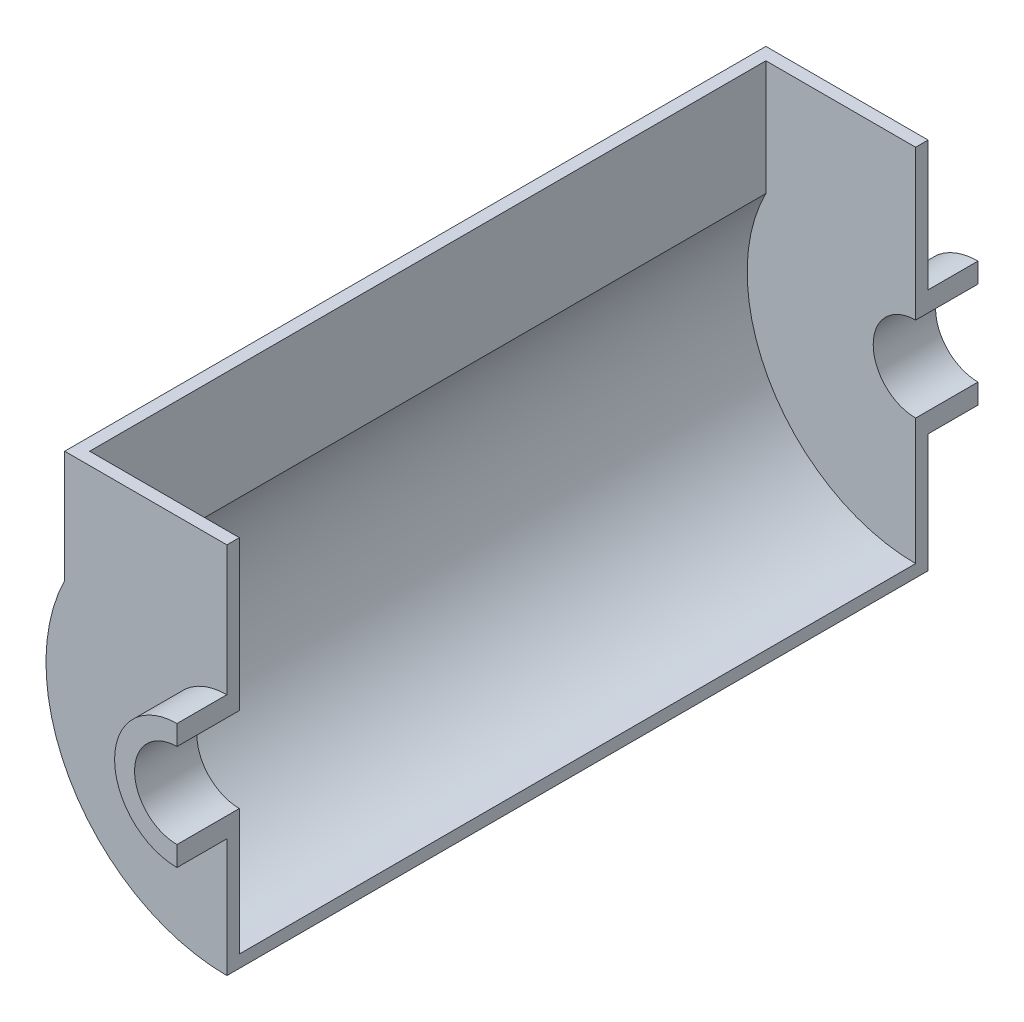
ISO-10303-21;
HEADER;
FILE_DESCRIPTION(('STEP AP214'),'2;1');
FILE_NAME('part.step','',(''),(''),'','','');
FILE_SCHEMA(('AUTOMOTIVE_DESIGN { 1 0 10303 214 1 1 1 1 }'));
ENDSEC;
DATA;
#1=APPLICATION_CONTEXT('core data for automotive mechanical design processes');
#2=APPLICATION_PROTOCOL_DEFINITION('international standard','automotive_design',2000,#1);
#3=PRODUCT_CONTEXT('',#1,'mechanical');
#4=PRODUCT('Part','Part','',(#3));
#5=PRODUCT_RELATED_PRODUCT_CATEGORY('part','',(#4));
#6=PRODUCT_DEFINITION_FORMATION('','',#4);
#7=PRODUCT_DEFINITION_CONTEXT('part definition',#1,'design');
#8=PRODUCT_DEFINITION('design','',#6,#7);
#9=PRODUCT_DEFINITION_SHAPE('','',#8);
#10=(LENGTH_UNIT() NAMED_UNIT(*) SI_UNIT(.MILLI.,.METRE.));
#11=(NAMED_UNIT(*) PLANE_ANGLE_UNIT() SI_UNIT($,.RADIAN.));
#12=(NAMED_UNIT(*) SI_UNIT($,.STERADIAN.) SOLID_ANGLE_UNIT());
#13=UNCERTAINTY_MEASURE_WITH_UNIT(LENGTH_MEASURE(1.E-05),#10,'distance_accuracy_value','');
#14=(GEOMETRIC_REPRESENTATION_CONTEXT(3) GLOBAL_UNCERTAINTY_ASSIGNED_CONTEXT((#13)) GLOBAL_UNIT_ASSIGNED_CONTEXT((#10,
#11,#12)) REPRESENTATION_CONTEXT('',''));
#15=CARTESIAN_POINT('',(0.,0.,0.));
#16=DIRECTION('',(0.,0.,1.));
#17=DIRECTION('',(1.,0.,0.));
#18=AXIS2_PLACEMENT_3D('',#15,#16,#17);
#19=CARTESIAN_POINT('',(0.,0.,-5.));
#20=DIRECTION('',(0.,0.,1.));
#21=DIRECTION('',(1.,0.,0.));
#22=AXIS2_PLACEMENT_3D('',#19,#20,#21);
#23=CYLINDRICAL_SURFACE('',#22,17.);
#24=DIRECTION('',(0.,0.,1.));
#25=VECTOR('',#24,1.);
#26=CARTESIAN_POINT('',(0.,17.,-5.));
#27=LINE('',#26,#25);
#28=CARTESIAN_POINT('',(0.,17.,-5.));
#29=VERTEX_POINT('',#28);
#30=CARTESIAN_POINT('',(0.,17.,20.));
#31=VERTEX_POINT('',#30);
#32=EDGE_CURVE('E44',#29,#31,#27,.T.);
#33=ORIENTED_EDGE('',*,*,#32,.T.);
#34=CARTESIAN_POINT('',(0.,0.,20.));
#35=DIRECTION('',(0.,0.,-1.));
#36=DIRECTION('',(1.,0.,0.));
#37=AXIS2_PLACEMENT_3D('',#34,#35,#36);
#38=CIRCLE('',#37,17.);
#39=CARTESIAN_POINT('',(0.,-17.,20.));
#40=VERTEX_POINT('',#39);
#41=EDGE_CURVE('E259',#40,#31,#38,.T.);
#42=ORIENTED_EDGE('',*,*,#41,.F.);
#43=DIRECTION('',(0.,0.,1.));
#44=VECTOR('',#43,1.);
#45=CARTESIAN_POINT('',(0.,-17.,-5.));
#46=LINE('',#45,#44);
#47=CARTESIAN_POINT('',(0.,-17.,-5.));
#48=VERTEX_POINT('',#47);
#49=EDGE_CURVE('E11',#48,#40,#46,.T.);
#50=ORIENTED_EDGE('',*,*,#49,.F.);
#51=CARTESIAN_POINT('',(0.,0.,-5.));
#52=DIRECTION('',(0.,0.,-1.));
#53=DIRECTION('',(1.,0.,0.));
#54=AXIS2_PLACEMENT_3D('',#51,#52,#53);
#55=CIRCLE('',#54,17.);
#56=EDGE_CURVE('E283',#48,#29,#55,.T.);
#57=ORIENTED_EDGE('',*,*,#56,.T.);
#58=EDGE_LOOP('',(#33,#42,#50,#57));
#59=FACE_BOUND('',#58,.T.);
#60=ADVANCED_FACE('F41',(#59),#23,.F.);
#61=CARTESIAN_POINT('',(0.,-17.,-5.));
#62=DIRECTION('',(1.,0.,0.));
#63=DIRECTION('',(0.,0.,-1.));
#64=AXIS2_PLACEMENT_3D('',#61,#62,#63);
#65=PLANE('',#64);
#66=ORIENTED_EDGE('',*,*,#49,.T.);
#67=DIRECTION('',(0.,1.,0.));
#68=VECTOR('',#67,1.);
#69=CARTESIAN_POINT('',(0.,-17.,20.));
#70=LINE('',#69,#68);
#71=CARTESIAN_POINT('',(0.,-25.,20.));
#72=VERTEX_POINT('',#71);
#73=EDGE_CURVE('E279',#72,#40,#70,.T.);
#74=ORIENTED_EDGE('',*,*,#73,.F.);
#75=DIRECTION('',(0.,0.,1.));
#76=VECTOR('',#75,1.);
#77=CARTESIAN_POINT('',(0.,-25.,-5.));
#78=LINE('',#77,#76);
#79=CARTESIAN_POINT('',(0.,-25.,0.));
#80=VERTEX_POINT('',#79);
#81=EDGE_CURVE('E50',#80,#72,#78,.T.);
#82=ORIENTED_EDGE('',*,*,#81,.F.);
#83=DIRECTION('',(0.,1.,0.));
#84=VECTOR('',#83,1.);
#85=CARTESIAN_POINT('',(0.,-25.,0.));
#86=LINE('',#85,#84);
#87=CARTESIAN_POINT('',(0.,-72.5,0.));
#88=VERTEX_POINT('',#87);
#89=EDGE_CURVE('E234',#88,#80,#86,.T.);
#90=ORIENTED_EDGE('',*,*,#89,.F.);
#91=DIRECTION('',(0.,0.,1.));
#92=VECTOR('',#91,1.);
#93=CARTESIAN_POINT('',(0.,-72.5,-5.));
#94=LINE('',#93,#92);
#95=CARTESIAN_POINT('',(0.,-72.5,-281.));
#96=VERTEX_POINT('',#95);
#97=EDGE_CURVE('E256',#96,#88,#94,.T.);
#98=ORIENTED_EDGE('',*,*,#97,.F.);
#99=DIRECTION('',(0.,1.,0.));
#100=VECTOR('',#99,1.);
#101=CARTESIAN_POINT('',(0.,-25.,-281.));
#102=LINE('',#101,#100);
#103=CARTESIAN_POINT('',(0.,-25.,-281.));
#104=VERTEX_POINT('',#103);
#105=EDGE_CURVE('E167',#96,#104,#102,.T.);
#106=ORIENTED_EDGE('',*,*,#105,.T.);
#107=DIRECTION('',(0.,0.,-1.));
#108=VECTOR('',#107,1.);
#109=CARTESIAN_POINT('',(0.,-25.,-276.));
#110=LINE('',#109,#108);
#111=CARTESIAN_POINT('',(0.,-25.,-301.));
#112=VERTEX_POINT('',#111);
#113=EDGE_CURVE('E199',#104,#112,#110,.T.);
#114=ORIENTED_EDGE('',*,*,#113,.T.);
#115=DIRECTION('',(0.,1.,0.));
#116=VECTOR('',#115,1.);
#117=CARTESIAN_POINT('',(0.,-17.,-301.));
#118=LINE('',#117,#116);
#119=CARTESIAN_POINT('',(0.,-17.,-301.));
#120=VERTEX_POINT('',#119);
#121=EDGE_CURVE('E190',#112,#120,#118,.T.);
#122=ORIENTED_EDGE('',*,*,#121,.T.);
#123=DIRECTION('',(0.,0.,-1.));
#124=VECTOR('',#123,1.);
#125=CARTESIAN_POINT('',(0.,-17.,-276.));
#126=LINE('',#125,#124);
#127=CARTESIAN_POINT('',(0.,-17.,-276.));
#128=VERTEX_POINT('',#127);
#129=EDGE_CURVE('E194',#128,#120,#126,.T.);
#130=ORIENTED_EDGE('',*,*,#129,.F.);
#131=DIRECTION('',(0.,1.,0.));
#132=VECTOR('',#131,1.);
#133=CARTESIAN_POINT('',(0.,-17.,-276.));
#134=LINE('',#133,#132);
#135=CARTESIAN_POINT('',(0.,-67.5,-276.));
#136=VERTEX_POINT('',#135);
#137=EDGE_CURVE('E184',#136,#128,#134,.T.);
#138=ORIENTED_EDGE('',*,*,#137,.F.);
#139=DIRECTION('',(0.,0.,1.));
#140=VECTOR('',#139,1.);
#141=CARTESIAN_POINT('',(0.,-67.5,-442.152038807834));
#142=LINE('',#141,#140);
#143=CARTESIAN_POINT('',(0.,-67.5,-5.));
#144=VERTEX_POINT('',#143);
#145=EDGE_CURVE('E223',#136,#144,#142,.T.);
#146=ORIENTED_EDGE('',*,*,#145,.T.);
#147=DIRECTION('',(0.,1.,0.));
#148=VECTOR('',#147,1.);
#149=CARTESIAN_POINT('',(0.,-17.,-5.));
#150=LINE('',#149,#148);
#151=EDGE_CURVE('E290',#144,#48,#150,.T.);
#152=ORIENTED_EDGE('',*,*,#151,.T.);
#153=EDGE_LOOP('',(#66,#74,#82,#90,#98,#106,#114,#122,#130,#138,#146,#152));
#154=FACE_BOUND('',#153,.T.);
#155=ADVANCED_FACE('F311',(#154),#65,.T.);
#156=CARTESIAN_POINT('',(0.,0.,-5.));
#157=DIRECTION('',(0.,0.,1.));
#158=DIRECTION('',(1.,0.,0.));
#159=AXIS2_PLACEMENT_3D('',#156,#157,#158);
#160=CYLINDRICAL_SURFACE('',#159,25.);
#161=CARTESIAN_POINT('',(0.,0.,0.));
#162=DIRECTION('',(0.,0.,-1.));
#163=DIRECTION('',(1.,0.,0.));
#164=AXIS2_PLACEMENT_3D('',#161,#162,#163);
#165=CIRCLE('',#164,25.);
#166=CARTESIAN_POINT('',(0.,25.,0.));
#167=VERTEX_POINT('',#166);
#168=EDGE_CURVE('E66',#80,#167,#165,.T.);
#169=ORIENTED_EDGE('',*,*,#168,.F.);
#170=ORIENTED_EDGE('',*,*,#81,.T.);
#171=CARTESIAN_POINT('',(0.,0.,20.));
#172=DIRECTION('',(0.,0.,1.));
#173=DIRECTION('',(1.,0.,0.));
#174=AXIS2_PLACEMENT_3D('',#171,#172,#173);
#175=CIRCLE('',#174,25.);
#176=CARTESIAN_POINT('',(0.,25.,20.));
#177=VERTEX_POINT('',#176);
#178=EDGE_CURVE('E275',#177,#72,#175,.T.);
#179=ORIENTED_EDGE('',*,*,#178,.F.);
#180=DIRECTION('',(0.,0.,1.));
#181=VECTOR('',#180,1.);
#182=CARTESIAN_POINT('',(0.,25.,-5.));
#183=LINE('',#182,#181);
#184=EDGE_CURVE('E294',#167,#177,#183,.T.);
#185=ORIENTED_EDGE('',*,*,#184,.F.);
#186=EDGE_LOOP('',(#169,#170,#179,#185));
#187=FACE_BOUND('',#186,.T.);
#188=ADVANCED_FACE('F385',(#187),#160,.T.);
#189=CARTESIAN_POINT('',(0.,25.,-5.));
#190=DIRECTION('',(1.,0.,0.));
#191=DIRECTION('',(0.,0.,-1.));
#192=AXIS2_PLACEMENT_3D('',#189,#190,#191);
#193=PLANE('',#192);
#194=DIRECTION('',(0.,1.,0.));
#195=VECTOR('',#194,1.);
#196=CARTESIAN_POINT('',(0.,25.,-5.));
#197=LINE('',#196,#195);
#198=CARTESIAN_POINT('',(0.,77.,-5.));
#199=VERTEX_POINT('',#198);
#200=EDGE_CURVE('E287',#29,#199,#197,.T.);
#201=ORIENTED_EDGE('',*,*,#200,.T.);
#202=DIRECTION('',(0.,0.,1.));
#203=VECTOR('',#202,1.);
#204=CARTESIAN_POINT('',(0.,77.,-5.));
#205=LINE('',#204,#203);
#206=CARTESIAN_POINT('',(0.,77.,0.));
#207=VERTEX_POINT('',#206);
#208=EDGE_CURVE('E233',#199,#207,#205,.T.);
#209=ORIENTED_EDGE('',*,*,#208,.T.);
#210=DIRECTION('',(0.,1.,0.));
#211=VECTOR('',#210,1.);
#212=CARTESIAN_POINT('',(0.,25.,0.));
#213=LINE('',#212,#211);
#214=EDGE_CURVE('E237',#167,#207,#213,.T.);
#215=ORIENTED_EDGE('',*,*,#214,.F.);
#216=ORIENTED_EDGE('',*,*,#184,.T.);
#217=DIRECTION('',(0.,1.,0.));
#218=VECTOR('',#217,1.);
#219=CARTESIAN_POINT('',(0.,25.,20.));
#220=LINE('',#219,#218);
#221=EDGE_CURVE('E271',#31,#177,#220,.T.);
#222=ORIENTED_EDGE('',*,*,#221,.F.);
#223=ORIENTED_EDGE('',*,*,#32,.F.);
#224=EDGE_LOOP('',(#201,#209,#215,#216,#222,#223));
#225=FACE_BOUND('',#224,.T.);
#226=ADVANCED_FACE('F305',(#225),#193,.T.);
#227=CARTESIAN_POINT('',(0.,0.,-5.));
#228=DIRECTION('',(0.,0.,1.));
#229=DIRECTION('',(1.,0.,0.));
#230=AXIS2_PLACEMENT_3D('',#227,#228,#229);
#231=PLANE('',#230);
#232=ORIENTED_EDGE('',*,*,#151,.F.);
#233=CARTESIAN_POINT('',(0.,0.,-5.));
#234=DIRECTION('',(0.,0.,-1.));
#235=DIRECTION('',(-1.,0.,0.));
#236=AXIS2_PLACEMENT_3D('',#233,#234,#235);
#237=CIRCLE('',#236,67.5);
#238=CARTESIAN_POINT('',(-60.,30.9232921921325,-5.));
#239=VERTEX_POINT('',#238);
#240=EDGE_CURVE('E198',#144,#239,#237,.T.);
#241=ORIENTED_EDGE('',*,*,#240,.T.);
#242=DIRECTION('',(0.,1.,0.));
#243=VECTOR('',#242,1.);
#244=CARTESIAN_POINT('',(-60.,0.,-5.));
#245=LINE('',#244,#243);
#246=CARTESIAN_POINT('',(-60.,77.,-5.));
#247=VERTEX_POINT('',#246);
#248=EDGE_CURVE('E209',#239,#247,#245,.T.);
#249=ORIENTED_EDGE('',*,*,#248,.T.);
#250=DIRECTION('',(-1.,0.,0.));
#251=VECTOR('',#250,1.);
#252=CARTESIAN_POINT('',(0.,77.,-5.));
#253=LINE('',#252,#251);
#254=EDGE_CURVE('E230',#199,#247,#253,.T.);
#255=ORIENTED_EDGE('',*,*,#254,.F.);
#256=ORIENTED_EDGE('',*,*,#200,.F.);
#257=ORIENTED_EDGE('',*,*,#56,.F.);
#258=EDGE_LOOP('',(#232,#241,#249,#255,#256,#257));
#259=FACE_BOUND('',#258,.T.);
#260=ADVANCED_FACE('F315',(#259),#231,.F.);
#261=CARTESIAN_POINT('',(0.,0.,20.));
#262=DIRECTION('',(0.,0.,1.));
#263=DIRECTION('',(1.,0.,0.));
#264=AXIS2_PLACEMENT_3D('',#261,#262,#263);
#265=PLANE('',#264);
#266=ORIENTED_EDGE('',*,*,#41,.T.);
#267=ORIENTED_EDGE('',*,*,#221,.T.);
#268=ORIENTED_EDGE('',*,*,#178,.T.);
#269=ORIENTED_EDGE('',*,*,#73,.T.);
#270=EDGE_LOOP('',(#266,#267,#268,#269));
#271=FACE_BOUND('',#270,.T.);
#272=ADVANCED_FACE('F308',(#271),#265,.T.);
#273=CARTESIAN_POINT('',(0.,0.,-5.));
#274=DIRECTION('',(0.,0.,1.));
#275=DIRECTION('',(1.,0.,0.));
#276=AXIS2_PLACEMENT_3D('',#273,#274,#275);
#277=CYLINDRICAL_SURFACE('',#276,72.5);
#278=CARTESIAN_POINT('',(0.,0.,0.));
#279=DIRECTION('',(0.,0.,1.));
#280=DIRECTION('',(-1.,0.,0.));
#281=AXIS2_PLACEMENT_3D('',#278,#279,#280);
#282=CIRCLE('',#281,72.5);
#283=CARTESIAN_POINT('',(-65.,32.1130814466629,0.));
#284=VERTEX_POINT('',#283);
#285=EDGE_CURVE('E249',#284,#88,#282,.T.);
#286=ORIENTED_EDGE('',*,*,#285,.F.);
#287=DIRECTION('',(0.,0.,1.));
#288=VECTOR('',#287,1.);
#289=CARTESIAN_POINT('',(-65.,32.1130814466629,-5.));
#290=LINE('',#289,#288);
#291=CARTESIAN_POINT('',(-65.,32.1130814466629,-281.));
#292=VERTEX_POINT('',#291);
#293=EDGE_CURVE('E260',#292,#284,#290,.T.);
#294=ORIENTED_EDGE('',*,*,#293,.F.);
#295=CARTESIAN_POINT('',(0.,0.,-281.));
#296=DIRECTION('',(0.,0.,1.));
#297=DIRECTION('',(-1.,0.,0.));
#298=AXIS2_PLACEMENT_3D('',#295,#296,#297);
#299=CIRCLE('',#298,72.5);
#300=EDGE_CURVE('E327',#292,#96,#299,.T.);
#301=ORIENTED_EDGE('',*,*,#300,.T.);
#302=ORIENTED_EDGE('',*,*,#97,.T.);
#303=EDGE_LOOP('',(#286,#294,#301,#302));
#304=FACE_BOUND('',#303,.T.);
#305=ADVANCED_FACE('F328',(#304),#277,.T.);
#306=CARTESIAN_POINT('',(-65.,77.,-5.));
#307=DIRECTION('',(-1.,0.,0.));
#308=DIRECTION('',(0.,-1.,0.));
#309=AXIS2_PLACEMENT_3D('',#306,#307,#308);
#310=PLANE('',#309);
#311=DIRECTION('',(0.,-1.,0.));
#312=VECTOR('',#311,1.);
#313=CARTESIAN_POINT('',(-65.,77.,0.));
#314=LINE('',#313,#312);
#315=CARTESIAN_POINT('',(-65.,77.,0.));
#316=VERTEX_POINT('',#315);
#317=EDGE_CURVE('E245',#316,#284,#314,.T.);
#318=ORIENTED_EDGE('',*,*,#317,.F.);
#319=DIRECTION('',(0.,0.,1.));
#320=VECTOR('',#319,1.);
#321=CARTESIAN_POINT('',(-65.,77.,-5.));
#322=LINE('',#321,#320);
#323=CARTESIAN_POINT('',(-65.,77.,-281.));
#324=VERTEX_POINT('',#323);
#325=EDGE_CURVE('E263',#324,#316,#322,.T.);
#326=ORIENTED_EDGE('',*,*,#325,.F.);
#327=DIRECTION('',(0.,-1.,0.));
#328=VECTOR('',#327,1.);
#329=CARTESIAN_POINT('',(-65.,77.,-281.));
#330=LINE('',#329,#328);
#331=EDGE_CURVE('E333',#324,#292,#330,.T.);
#332=ORIENTED_EDGE('',*,*,#331,.T.);
#333=ORIENTED_EDGE('',*,*,#293,.T.);
#334=EDGE_LOOP('',(#318,#326,#332,#333));
#335=FACE_BOUND('',#334,.T.);
#336=ADVANCED_FACE('F372',(#335),#310,.T.);
#337=CARTESIAN_POINT('',(0.,77.,-5.));
#338=DIRECTION('',(0.,1.,0.));
#339=DIRECTION('',(0.,0.,1.));
#340=AXIS2_PLACEMENT_3D('',#337,#338,#339);
#341=PLANE('',#340);
#342=DIRECTION('',(-1.,0.,0.));
#343=VECTOR('',#342,1.);
#344=CARTESIAN_POINT('',(0.,77.,0.));
#345=LINE('',#344,#343);
#346=EDGE_CURVE('E241',#207,#316,#345,.T.);
#347=ORIENTED_EDGE('',*,*,#346,.F.);
#348=ORIENTED_EDGE('',*,*,#208,.F.);
#349=ORIENTED_EDGE('',*,*,#254,.T.);
#350=DIRECTION('',(0.,0.,1.));
#351=VECTOR('',#350,1.);
#352=CARTESIAN_POINT('',(-60.,77.,-442.152038807834));
#353=LINE('',#352,#351);
#354=CARTESIAN_POINT('',(-60.,77.,-276.));
#355=VERTEX_POINT('',#354);
#356=EDGE_CURVE('E58',#355,#247,#353,.T.);
#357=ORIENTED_EDGE('',*,*,#356,.F.);
#358=DIRECTION('',(-1.,0.,0.));
#359=VECTOR('',#358,1.);
#360=CARTESIAN_POINT('',(0.,77.,-276.));
#361=LINE('',#360,#359);
#362=CARTESIAN_POINT('',(0.,77.,-276.));
#363=VERTEX_POINT('',#362);
#364=EDGE_CURVE('E156',#363,#355,#361,.T.);
#365=ORIENTED_EDGE('',*,*,#364,.F.);
#366=DIRECTION('',(0.,0.,-1.));
#367=VECTOR('',#366,1.);
#368=CARTESIAN_POINT('',(0.,77.,-276.));
#369=LINE('',#368,#367);
#370=CARTESIAN_POINT('',(0.,77.,-281.));
#371=VERTEX_POINT('',#370);
#372=EDGE_CURVE('E161',#363,#371,#369,.T.);
#373=ORIENTED_EDGE('',*,*,#372,.T.);
#374=DIRECTION('',(-1.,0.,0.));
#375=VECTOR('',#374,1.);
#376=CARTESIAN_POINT('',(0.,77.,-281.));
#377=LINE('',#376,#375);
#378=EDGE_CURVE('E366',#371,#324,#377,.T.);
#379=ORIENTED_EDGE('',*,*,#378,.T.);
#380=ORIENTED_EDGE('',*,*,#325,.T.);
#381=EDGE_LOOP('',(#347,#348,#349,#357,#365,#373,#379,#380));
#382=FACE_BOUND('',#381,.T.);
#383=ADVANCED_FACE('F159',(#382),#341,.T.);
#384=CARTESIAN_POINT('',(0.,0.,0.));
#385=DIRECTION('',(0.,0.,1.));
#386=DIRECTION('',(1.,0.,0.));
#387=AXIS2_PLACEMENT_3D('',#384,#385,#386);
#388=PLANE('',#387);
#389=ORIENTED_EDGE('',*,*,#168,.T.);
#390=ORIENTED_EDGE('',*,*,#214,.T.);
#391=ORIENTED_EDGE('',*,*,#346,.T.);
#392=ORIENTED_EDGE('',*,*,#317,.T.);
#393=ORIENTED_EDGE('',*,*,#285,.T.);
#394=ORIENTED_EDGE('',*,*,#89,.T.);
#395=EDGE_LOOP('',(#389,#390,#391,#392,#393,#394));
#396=FACE_BOUND('',#395,.T.);
#397=ADVANCED_FACE('F320',(#396),#388,.T.);
#398=CARTESIAN_POINT('',(-60.,0.,-442.152038807834));
#399=DIRECTION('',(1.,0.,0.));
#400=DIRECTION('',(0.,0.,-1.));
#401=AXIS2_PLACEMENT_3D('',#398,#399,#400);
#402=PLANE('',#401);
#403=DIRECTION('',(0.,0.,1.));
#404=VECTOR('',#403,1.);
#405=CARTESIAN_POINT('',(-60.,30.9232921921325,-442.152038807834));
#406=LINE('',#405,#404);
#407=CARTESIAN_POINT('',(-60.,30.9232921921325,-276.));
#408=VERTEX_POINT('',#407);
#409=EDGE_CURVE('E222',#408,#239,#406,.T.);
#410=ORIENTED_EDGE('',*,*,#409,.F.);
#411=DIRECTION('',(0.,1.,0.));
#412=VECTOR('',#411,1.);
#413=CARTESIAN_POINT('',(-60.,0.,-276.));
#414=LINE('',#413,#412);
#415=EDGE_CURVE('E212',#408,#355,#414,.T.);
#416=ORIENTED_EDGE('',*,*,#415,.T.);
#417=ORIENTED_EDGE('',*,*,#356,.T.);
#418=ORIENTED_EDGE('',*,*,#248,.F.);
#419=EDGE_LOOP('',(#410,#416,#417,#418));
#420=FACE_BOUND('',#419,.T.);
#421=ADVANCED_FACE('F430',(#420),#402,.T.);
#422=CARTESIAN_POINT('',(0.,0.,-442.152038807834));
#423=DIRECTION('',(0.,0.,1.));
#424=DIRECTION('',(1.,0.,0.));
#425=AXIS2_PLACEMENT_3D('',#422,#423,#424);
#426=CYLINDRICAL_SURFACE('',#425,67.5);
#427=ORIENTED_EDGE('',*,*,#145,.F.);
#428=CARTESIAN_POINT('',(0.,0.,-276.));
#429=DIRECTION('',(0.,0.,-1.));
#430=DIRECTION('',(-1.,0.,0.));
#431=AXIS2_PLACEMENT_3D('',#428,#429,#430);
#432=CIRCLE('',#431,67.5);
#433=EDGE_CURVE('E218',#136,#408,#432,.T.);
#434=ORIENTED_EDGE('',*,*,#433,.T.);
#435=ORIENTED_EDGE('',*,*,#409,.T.);
#436=ORIENTED_EDGE('',*,*,#240,.F.);
#437=EDGE_LOOP('',(#427,#434,#435,#436));
#438=FACE_BOUND('',#437,.T.);
#439=ADVANCED_FACE('F434',(#438),#426,.F.);
#440=CARTESIAN_POINT('',(0.,0.,-276.));
#441=DIRECTION('',(0.,0.,-1.));
#442=DIRECTION('',(1.,0.,0.));
#443=AXIS2_PLACEMENT_3D('',#440,#441,#442);
#444=CYLINDRICAL_SURFACE('',#443,17.);
#445=DIRECTION('',(0.,0.,-1.));
#446=VECTOR('',#445,1.);
#447=CARTESIAN_POINT('',(0.,17.,-276.));
#448=LINE('',#447,#446);
#449=CARTESIAN_POINT('',(0.,17.,-276.));
#450=VERTEX_POINT('',#449);
#451=CARTESIAN_POINT('',(0.,17.,-301.));
#452=VERTEX_POINT('',#451);
#453=EDGE_CURVE('E188',#450,#452,#448,.T.);
#454=ORIENTED_EDGE('',*,*,#453,.F.);
#455=CARTESIAN_POINT('',(0.,0.,-276.));
#456=DIRECTION('',(0.,0.,-1.));
#457=DIRECTION('',(1.,0.,0.));
#458=AXIS2_PLACEMENT_3D('',#455,#456,#457);
#459=CIRCLE('',#458,17.);
#460=EDGE_CURVE('E181',#128,#450,#459,.T.);
#461=ORIENTED_EDGE('',*,*,#460,.F.);
#462=ORIENTED_EDGE('',*,*,#129,.T.);
#463=CARTESIAN_POINT('',(0.,0.,-301.));
#464=DIRECTION('',(0.,0.,-1.));
#465=DIRECTION('',(1.,0.,0.));
#466=AXIS2_PLACEMENT_3D('',#463,#464,#465);
#467=CIRCLE('',#466,17.);
#468=EDGE_CURVE('E177',#120,#452,#467,.T.);
#469=ORIENTED_EDGE('',*,*,#468,.T.);
#470=EDGE_LOOP('',(#454,#461,#462,#469));
#471=FACE_BOUND('',#470,.T.);
#472=ADVANCED_FACE('F360',(#471),#444,.F.);
#473=CARTESIAN_POINT('',(0.,0.,-276.));
#474=DIRECTION('',(0.,0.,-1.));
#475=DIRECTION('',(1.,0.,0.));
#476=AXIS2_PLACEMENT_3D('',#473,#474,#475);
#477=CYLINDRICAL_SURFACE('',#476,25.);
#478=CARTESIAN_POINT('',(0.,0.,-281.));
#479=DIRECTION('',(0.,0.,-1.));
#480=DIRECTION('',(1.,0.,0.));
#481=AXIS2_PLACEMENT_3D('',#478,#479,#480);
#482=CIRCLE('',#481,25.);
#483=CARTESIAN_POINT('',(0.,25.,-281.));
#484=VERTEX_POINT('',#483);
#485=EDGE_CURVE('E337',#104,#484,#482,.T.);
#486=ORIENTED_EDGE('',*,*,#485,.T.);
#487=DIRECTION('',(0.,0.,-1.));
#488=VECTOR('',#487,1.);
#489=CARTESIAN_POINT('',(0.,25.,-276.));
#490=LINE('',#489,#488);
#491=CARTESIAN_POINT('',(0.,25.,-301.));
#492=VERTEX_POINT('',#491);
#493=EDGE_CURVE('E203',#484,#492,#490,.T.);
#494=ORIENTED_EDGE('',*,*,#493,.T.);
#495=CARTESIAN_POINT('',(0.,0.,-301.));
#496=DIRECTION('',(0.,0.,1.));
#497=DIRECTION('',(1.,0.,0.));
#498=AXIS2_PLACEMENT_3D('',#495,#496,#497);
#499=CIRCLE('',#498,25.);
#500=EDGE_CURVE('E349',#492,#112,#499,.T.);
#501=ORIENTED_EDGE('',*,*,#500,.T.);
#502=ORIENTED_EDGE('',*,*,#113,.F.);
#503=EDGE_LOOP('',(#486,#494,#501,#502));
#504=FACE_BOUND('',#503,.T.);
#505=ADVANCED_FACE('F362',(#504),#477,.T.);
#506=CARTESIAN_POINT('',(0.,25.,-276.));
#507=DIRECTION('',(1.,0.,0.));
#508=DIRECTION('',(0.,0.,1.));
#509=AXIS2_PLACEMENT_3D('',#506,#507,#508);
#510=PLANE('',#509);
#511=DIRECTION('',(0.,1.,0.));
#512=VECTOR('',#511,1.);
#513=CARTESIAN_POINT('',(0.,25.,-276.));
#514=LINE('',#513,#512);
#515=EDGE_CURVE('E172',#450,#363,#514,.T.);
#516=ORIENTED_EDGE('',*,*,#515,.F.);
#517=ORIENTED_EDGE('',*,*,#453,.T.);
#518=DIRECTION('',(0.,1.,0.));
#519=VECTOR('',#518,1.);
#520=CARTESIAN_POINT('',(0.,25.,-301.));
#521=LINE('',#520,#519);
#522=EDGE_CURVE('E346',#452,#492,#521,.T.);
#523=ORIENTED_EDGE('',*,*,#522,.T.);
#524=ORIENTED_EDGE('',*,*,#493,.F.);
#525=DIRECTION('',(0.,1.,0.));
#526=VECTOR('',#525,1.);
#527=CARTESIAN_POINT('',(0.,25.,-281.));
#528=LINE('',#527,#526);
#529=EDGE_CURVE('E175',#484,#371,#528,.T.);
#530=ORIENTED_EDGE('',*,*,#529,.T.);
#531=ORIENTED_EDGE('',*,*,#372,.F.);
#532=EDGE_LOOP('',(#516,#517,#523,#524,#530,#531));
#533=FACE_BOUND('',#532,.T.);
#534=ADVANCED_FACE('F170',(#533),#510,.T.);
#535=CARTESIAN_POINT('',(0.,0.,-276.));
#536=DIRECTION('',(0.,0.,-1.));
#537=DIRECTION('',(1.,0.,0.));
#538=AXIS2_PLACEMENT_3D('',#535,#536,#537);
#539=PLANE('',#538);
#540=ORIENTED_EDGE('',*,*,#433,.F.);
#541=ORIENTED_EDGE('',*,*,#137,.T.);
#542=ORIENTED_EDGE('',*,*,#460,.T.);
#543=ORIENTED_EDGE('',*,*,#515,.T.);
#544=ORIENTED_EDGE('',*,*,#364,.T.);
#545=ORIENTED_EDGE('',*,*,#415,.F.);
#546=EDGE_LOOP('',(#540,#541,#542,#543,#544,#545));
#547=FACE_BOUND('',#546,.T.);
#548=ADVANCED_FACE('F179',(#547),#539,.F.);
#549=CARTESIAN_POINT('',(0.,0.,-301.));
#550=DIRECTION('',(0.,0.,-1.));
#551=DIRECTION('',(1.,0.,0.));
#552=AXIS2_PLACEMENT_3D('',#549,#550,#551);
#553=PLANE('',#552);
#554=ORIENTED_EDGE('',*,*,#468,.F.);
#555=ORIENTED_EDGE('',*,*,#121,.F.);
#556=ORIENTED_EDGE('',*,*,#500,.F.);
#557=ORIENTED_EDGE('',*,*,#522,.F.);
#558=EDGE_LOOP('',(#554,#555,#556,#557));
#559=FACE_BOUND('',#558,.T.);
#560=ADVANCED_FACE('F358',(#559),#553,.T.);
#561=CARTESIAN_POINT('',(0.,0.,-281.));
#562=DIRECTION('',(0.,0.,-1.));
#563=DIRECTION('',(1.,0.,0.));
#564=AXIS2_PLACEMENT_3D('',#561,#562,#563);
#565=PLANE('',#564);
#566=ORIENTED_EDGE('',*,*,#485,.F.);
#567=ORIENTED_EDGE('',*,*,#105,.F.);
#568=ORIENTED_EDGE('',*,*,#300,.F.);
#569=ORIENTED_EDGE('',*,*,#331,.F.);
#570=ORIENTED_EDGE('',*,*,#378,.F.);
#571=ORIENTED_EDGE('',*,*,#529,.F.);
#572=EDGE_LOOP('',(#566,#567,#568,#569,#570,#571));
#573=FACE_BOUND('',#572,.T.);
#574=ADVANCED_FACE('F335',(#573),#565,.T.);
#575=CLOSED_SHELL('',(#60,#155,#188,#226,#260,#272,#305,#336,#383,#397,#421,#439,#472,#505,#534,
#548,#560,#574));
#576=MANIFOLD_SOLID_BREP('B2',#575);
#577=ADVANCED_BREP_SHAPE_REPRESENTATION('',(#18,#576),#14);
#578=SHAPE_DEFINITION_REPRESENTATION(#9,#577);
ENDSEC;
END-ISO-10303-21;
